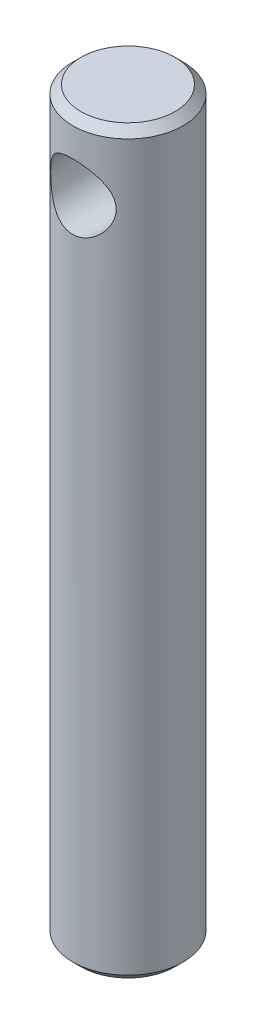
ISO-10303-21;
HEADER;
FILE_DESCRIPTION(('STEP AP214'),'2;1');
FILE_NAME('part.step','',(''),(''),'','','');
FILE_SCHEMA(('AUTOMOTIVE_DESIGN { 1 0 10303 214 1 1 1 1 }'));
ENDSEC;
DATA;
#1=APPLICATION_CONTEXT('core data for automotive mechanical design processes');
#2=APPLICATION_PROTOCOL_DEFINITION('international standard','automotive_design',2000,#1);
#3=PRODUCT_CONTEXT('',#1,'mechanical');
#4=PRODUCT('Part','Part','',(#3));
#5=PRODUCT_RELATED_PRODUCT_CATEGORY('part','',(#4));
#6=PRODUCT_DEFINITION_FORMATION('','',#4);
#7=PRODUCT_DEFINITION_CONTEXT('part definition',#1,'design');
#8=PRODUCT_DEFINITION('design','',#6,#7);
#9=PRODUCT_DEFINITION_SHAPE('','',#8);
#10=(LENGTH_UNIT() NAMED_UNIT(*) SI_UNIT(.MILLI.,.METRE.));
#11=(NAMED_UNIT(*) PLANE_ANGLE_UNIT() SI_UNIT($,.RADIAN.));
#12=(NAMED_UNIT(*) SI_UNIT($,.STERADIAN.) SOLID_ANGLE_UNIT());
#13=UNCERTAINTY_MEASURE_WITH_UNIT(LENGTH_MEASURE(1.E-05),#10,'distance_accuracy_value','');
#14=(GEOMETRIC_REPRESENTATION_CONTEXT(3) GLOBAL_UNCERTAINTY_ASSIGNED_CONTEXT((#13)) GLOBAL_UNIT_ASSIGNED_CONTEXT((#10,
#11,#12)) REPRESENTATION_CONTEXT('',''));
#15=CARTESIAN_POINT('',(0.,0.,0.));
#16=DIRECTION('',(0.,0.,1.));
#17=DIRECTION('',(1.,0.,0.));
#18=AXIS2_PLACEMENT_3D('',#15,#16,#17);
#19=CARTESIAN_POINT('',(0.,181.,0.));
#20=DIRECTION('',(0.,-1.,0.));
#21=DIRECTION('',(0.,0.,-1.));
#22=AXIS2_PLACEMENT_3D('',#19,#20,#21);
#23=CYLINDRICAL_SURFACE('',#22,13.5);
#24=CARTESIAN_POINT('',(0.,179.,0.));
#25=DIRECTION('',(0.,1.,0.));
#26=DIRECTION('',(0.,0.,1.));
#27=AXIS2_PLACEMENT_3D('',#24,#25,#26);
#28=CIRCLE('',#27,13.5);
#29=CARTESIAN_POINT('',(0.,179.,13.5));
#30=VERTEX_POINT('',#29);
#31=EDGE_CURVE('E39',#30,#30,#28,.F.);
#32=ORIENTED_EDGE('',*,*,#31,.T.);
#33=EDGE_LOOP('',(#32));
#34=FACE_BOUND('',#33,.T.);
#35=CARTESIAN_POINT('',(0.,2.,0.));
#36=DIRECTION('',(0.,1.,0.));
#37=DIRECTION('',(0.,0.,1.));
#38=AXIS2_PLACEMENT_3D('',#35,#36,#37);
#39=CIRCLE('',#38,13.5);
#40=CARTESIAN_POINT('',(0.,2.,13.5));
#41=VERTEX_POINT('',#40);
#42=EDGE_CURVE('E43',#41,#41,#39,.T.);
#43=ORIENTED_EDGE('',*,*,#42,.T.);
#44=EDGE_LOOP('',(#43));
#45=FACE_BOUND('',#44,.T.);
#46=CARTESIAN_POINT('',(0.,172.,-13.5));
#47=CARTESIAN_POINT('',(-0.205122931176962,171.999998343756,-13.4999984706654));
#48=CARTESIAN_POINT('',(-0.41030968731954,171.992098137591,-13.4953127723332));
#49=CARTESIAN_POINT('',(-0.819141753344282,171.960595967104,-13.4766810212997));
#50=CARTESIAN_POINT('',(-1.0227860123282,171.936984128209,-13.4627291449269));
#51=CARTESIAN_POINT('',(-1.42728944357705,171.874313427976,-13.4258768138681));
#52=CARTESIAN_POINT('',(-1.62814212125922,171.835223299433,-13.4029582469779));
#53=CARTESIAN_POINT('',(-2.02526903490092,171.742086703841,-13.3487255680575));
#54=CARTESIAN_POINT('',(-2.2215412711851,171.688033832243,-13.3174078610974));
#55=CARTESIAN_POINT('',(-2.60710044914417,171.56595647582,-13.2473097212851));
#56=CARTESIAN_POINT('',(-2.79641952640403,171.49800942811,-13.2085707223819));
#57=CARTESIAN_POINT('',(-3.16819309454819,171.348653371793,-13.1243629595229));
#58=CARTESIAN_POINT('',(-3.35064490164156,171.267239165798,-13.0788915980566));
#59=CARTESIAN_POINT('',(-3.70759632054505,171.091773017542,-12.9822141132811));
#60=CARTESIAN_POINT('',(-3.88210196567982,170.997730885075,-12.9310124465547));
#61=CARTESIAN_POINT('',(-4.2226206214687,170.797683998483,-12.8238603317318));
#62=CARTESIAN_POINT('',(-4.38863046858383,170.691674834685,-12.7679081350303));
#63=CARTESIAN_POINT('',(-4.89718414110188,170.339996691162,-12.5858330445619));
#64=CARTESIAN_POINT('',(-5.22341790700596,170.07380246969,-12.4529468182507));
#65=CARTESIAN_POINT('',(-5.82936656276922,169.494946649173,-12.1810937765254));
#66=CARTESIAN_POINT('',(-6.10902175775845,169.182226379139,-12.0421194422138));
#67=CARTESIAN_POINT('',(-6.50520782052548,168.662327776831,-11.8303992839742));
#68=CARTESIAN_POINT('',(-6.63936720209025,168.469263745104,-11.7554216876498));
#69=CARTESIAN_POINT('',(-6.8908652288587,168.070807118774,-11.609783433664));
#70=CARTESIAN_POINT('',(-7.00820120063715,167.865412572059,-11.5391234631425));
#71=CARTESIAN_POINT('',(-7.22484399489974,167.443515156213,-11.4047302769881));
#72=CARTESIAN_POINT('',(-7.32417406468949,167.227027080084,-11.3409881730563));
#73=CARTESIAN_POINT('',(-7.50381963098546,166.783846649798,-11.222934423756));
#74=CARTESIAN_POINT('',(-7.58414199724749,166.557158017684,-11.1686193731639));
#75=CARTESIAN_POINT('',(-7.70795943714299,166.14973876555,-11.0833927077012));
#76=CARTESIAN_POINT('',(-7.75567185156903,165.970802408651,-11.0499835537045));
#77=CARTESIAN_POINT('',(-7.83876309883678,165.608806310971,-10.991196056065));
#78=CARTESIAN_POINT('',(-7.87414459111243,165.425747468372,-10.9658159808844));
#79=CARTESIAN_POINT('',(-7.93208960481248,165.056783615112,-10.9239752592024));
#80=CARTESIAN_POINT('',(-7.95466580537518,164.87088160762,-10.9075057906269));
#81=CARTESIAN_POINT('',(-7.98672547282611,164.497345023897,-10.8840532203254));
#82=CARTESIAN_POINT('',(-7.99620870341151,164.309710416457,-10.8770702898131));
#83=CARTESIAN_POINT('',(-8.00193828874021,163.93379097889,-10.8728559818045));
#84=CARTESIAN_POINT('',(-7.99816084764292,163.745505586187,-10.8756421345971));
#85=CARTESIAN_POINT('',(-7.97737627294427,163.370065949334,-10.8908967202689));
#86=CARTESIAN_POINT('',(-7.96036907765031,163.182911710462,-10.9033651982984));
#87=CARTESIAN_POINT('',(-7.91337303541688,162.811019662174,-10.9375210319713));
#88=CARTESIAN_POINT('',(-7.88337852601511,162.626282943032,-10.9592124087195));
#89=CARTESIAN_POINT('',(-7.81080898822977,162.260442530172,-11.0110510917449));
#90=CARTESIAN_POINT('',(-7.76822883364468,162.079340348982,-11.041201843317));
#91=CARTESIAN_POINT('',(-7.67153392214044,161.723788188133,-11.1086001105235));
#92=CARTESIAN_POINT('',(-7.61754951032847,161.549287312154,-11.1457669635968));
#93=CARTESIAN_POINT('',(-7.49830790922817,161.205633614546,-11.2263329483964));
#94=CARTESIAN_POINT('',(-7.43304703041511,161.036482564811,-11.2697341191304));
#95=CARTESIAN_POINT('',(-7.22117432928154,160.538074590643,-11.4075872311667));
#96=CARTESIAN_POINT('',(-7.0584239814666,160.21768715253,-11.5097240115744));
#97=CARTESIAN_POINT('',(-6.66247402643238,159.551838280788,-11.7440543621878));
#98=CARTESIAN_POINT('',(-6.42198486582337,159.211467447191,-11.878400495209));
#99=CARTESIAN_POINT('',(-6.02466132616965,158.732497566782,-12.0820427711885));
#100=CARTESIAN_POINT('',(-5.88600161408107,158.57799915745,-12.1503304832045));
#101=CARTESIAN_POINT('',(-5.59686531747619,158.280018656814,-12.28619478169));
#102=CARTESIAN_POINT('',(-5.44638665906639,158.13653850768,-12.353771240985));
#103=CARTESIAN_POINT('',(-5.11342266365445,157.843012578185,-12.4955936502826));
#104=CARTESIAN_POINT('',(-4.92934072005559,157.694625523672,-12.5695334520902));
#105=CARTESIAN_POINT('',(-4.547609912739,157.414005009921,-12.7126224432408));
#106=CARTESIAN_POINT('',(-4.34996643209302,157.281765198526,-12.7817735117576));
#107=CARTESIAN_POINT('',(-3.94205841605494,157.034583098467,-12.9134074362129));
#108=CARTESIAN_POINT('',(-3.73179575996588,156.91963824306,-12.9758912812324));
#109=CARTESIAN_POINT('',(-3.29988979614193,156.708326471527,-13.0923920961945));
#110=CARTESIAN_POINT('',(-3.07824791157265,156.611957239337,-13.1464101215234));
#111=CARTESIAN_POINT('',(-2.63989262491531,156.444712590565,-13.2411455573001));
#112=CARTESIAN_POINT('',(-2.42379373851601,156.372588089131,-13.2824988684139));
#113=CARTESIAN_POINT('',(-1.98464521869019,156.246720575252,-13.3551749407203));
#114=CARTESIAN_POINT('',(-1.76159580134518,156.192976991994,-13.3864980133972));
#115=CARTESIAN_POINT('',(-1.31067843201884,156.104757850273,-13.4381386306378));
#116=CARTESIAN_POINT('',(-1.08281526319764,156.070264020151,-13.4584666110582));
#117=CARTESIAN_POINT('',(-0.624238580697323,156.021060133653,-13.4875157829987));
#118=CARTESIAN_POINT('',(-0.393525449189501,156.006347453135,-13.4962385140549));
#119=CARTESIAN_POINT('',(0.037876672442782,155.997576776386,-13.5014361348051));
#120=CARTESIAN_POINT('',(0.23850295490903,156.001045490512,-13.4993776671767));
#121=CARTESIAN_POINT('',(0.638640809631457,156.023015763461,-13.4863707718972));
#122=CARTESIAN_POINT('',(0.838152413410018,156.041516894989,-13.4754225969356));
#123=CARTESIAN_POINT('',(1.23455794778152,156.093305143134,-13.4449019138791));
#124=CARTESIAN_POINT('',(1.43145203899228,156.126591348145,-13.4253299375047));
#125=CARTESIAN_POINT('',(1.82126136798946,156.207526758632,-13.3780253653781));
#126=CARTESIAN_POINT('',(2.01417650025611,156.255176344495,-13.3502925535022));
#127=CARTESIAN_POINT('',(2.39085762808701,156.363156275801,-13.2879448244289));
#128=CARTESIAN_POINT('',(2.57473032701227,156.423203983128,-13.2534841015468));
#129=CARTESIAN_POINT('',(2.93650337424312,156.555933754035,-13.1780558295579));
#130=CARTESIAN_POINT('',(3.11440174298445,156.628619956985,-13.1370861490134));
#131=CARTESIAN_POINT('',(3.63772021230856,156.864649779632,-13.0056152632673));
#132=CARTESIAN_POINT('',(3.97303694654272,157.046043984512,-12.9065051976663));
#133=CARTESIAN_POINT('',(4.64414667633844,157.472644541888,-12.6814886425768));
#134=CARTESIAN_POINT('',(4.97635388183314,157.72252860721,-12.5538665397381));
#135=CARTESIAN_POINT('',(5.59683667009501,158.268822776691,-12.2897974702756));
#136=CARTESIAN_POINT('',(5.88506021395218,158.565287163469,-12.1533403181474));
#137=CARTESIAN_POINT('',(6.29750224230008,159.060824047299,-11.9423385209066));
#138=CARTESIAN_POINT('',(6.43837099779284,159.245881454074,-11.8667829553649));
#139=CARTESIAN_POINT('',(6.7040330382913,159.628483436868,-11.7187468487954));
#140=CARTESIAN_POINT('',(6.82882379796969,159.826029967273,-11.6462667920254));
#141=CARTESIAN_POINT('',(7.06125094454737,160.232570680755,-11.506828543792));
#142=CARTESIAN_POINT('',(7.16890262366966,160.441554432744,-11.4398654558908));
#143=CARTESIAN_POINT('',(7.36611990231876,160.87016326196,-11.3138841290262));
#144=CARTESIAN_POINT('',(7.455691303401,161.089784897592,-11.2548633435889));
#145=CARTESIAN_POINT('',(7.59831555682666,161.489927623979,-11.1589116515974));
#146=CARTESIAN_POINT('',(7.65507745225127,161.668649814471,-11.1199628798627));
#147=CARTESIAN_POINT('',(7.75617019210315,162.030949498007,-11.0496885843209));
#148=CARTESIAN_POINT('',(7.8005086014505,162.214523961541,-11.0183584229255));
#149=CARTESIAN_POINT('',(7.87621469797193,162.585421878416,-10.9643699469353));
#150=CARTESIAN_POINT('',(7.90759396053866,162.772741828694,-10.9417038947219));
#151=CARTESIAN_POINT('',(7.95699523265755,163.150046162119,-10.9058316583184));
#152=CARTESIAN_POINT('',(7.97501712893093,163.340030567848,-10.8926255543545));
#153=CARTESIAN_POINT('',(7.99745812033672,163.721867736,-10.8761602279497));
#154=CARTESIAN_POINT('',(8.0018321124445,163.913724595854,-10.8729339868456));
#155=CARTESIAN_POINT('',(7.996778112766,164.297156559766,-10.8766515466055));
#156=CARTESIAN_POINT('',(7.98735008406233,164.488731663069,-10.8835953746723));
#157=CARTESIAN_POINT('',(7.95483727212307,164.870187875616,-10.9073812508997));
#158=CARTESIAN_POINT('',(7.93174562421614,165.060068084629,-10.9242282744479));
#159=CARTESIAN_POINT('',(7.87225290532894,165.436655864536,-10.9671771278067));
#160=CARTESIAN_POINT('',(7.8358517253291,165.62336340943,-10.9932790334249));
#161=CARTESIAN_POINT('',(7.75194341298969,165.985057252961,-11.0525969465292));
#162=CARTESIAN_POINT('',(7.70493742499579,166.160213974115,-11.08548750366));
#163=CARTESIAN_POINT('',(7.59961179114273,166.505702153153,-11.1579558738974));
#164=CARTESIAN_POINT('',(7.54128831449775,166.676031954767,-11.1975359507106));
#165=CARTESIAN_POINT('',(7.35014402665028,167.178647907142,-11.3247003980992));
#166=CARTESIAN_POINT('',(7.20110593141275,167.50274480264,-11.4207410887993));
#167=CARTESIAN_POINT('',(6.83759533101135,168.173054345092,-11.6425574956993));
#168=CARTESIAN_POINT('',(6.61656952026614,168.514942501525,-11.7706347614511));
#169=CARTESIAN_POINT('',(6.24942221440435,168.998577087836,-11.9672101055936));
#170=CARTESIAN_POINT('',(6.12100398845159,169.155020281687,-12.0335258078162));
#171=CARTESIAN_POINT('',(5.85266870926557,169.457762676791,-12.1662915906787));
#172=CARTESIAN_POINT('',(5.71274980853131,169.604060241233,-12.2327416912298));
#173=CARTESIAN_POINT('',(5.39961220618118,169.907515499742,-12.3744932154749));
#174=CARTESIAN_POINT('',(5.22457710182643,170.062899085935,-12.4495896248399));
#175=CARTESIAN_POINT('',(4.86068650491981,170.358351172897,-12.5961177516524));
#176=CARTESIAN_POINT('',(4.67183545178352,170.498424557454,-12.6675506338437));
#177=CARTESIAN_POINT('',(4.28098686300635,170.762305913232,-12.8049241695868));
#178=CARTESIAN_POINT('',(4.07898067749012,170.886103017518,-12.8708611431256));
#179=CARTESIAN_POINT('',(3.66302585983885,171.116087339016,-12.9953588122696));
#180=CARTESIAN_POINT('',(3.44907886127284,171.222276957175,-13.0539205133003));
#181=CARTESIAN_POINT('',(3.01899528399243,171.412069673333,-13.159894388941));
#182=CARTESIAN_POINT('',(2.80325651083394,171.496382150513,-13.2076477255457));
#183=CARTESIAN_POINT('',(2.36354019375161,171.646411905496,-13.2933751193557));
#184=CARTESIAN_POINT('',(2.13956422012375,171.712132706965,-13.3313510295467));
#185=CARTESIAN_POINT('',(1.6859447781057,171.823808893194,-13.3962654258179));
#186=CARTESIAN_POINT('',(1.45632169501934,171.869826733885,-13.4232387755874));
#187=CARTESIAN_POINT('',(0.992996429170178,171.941588156701,-13.4654361798352));
#188=CARTESIAN_POINT('',(0.759297932027846,171.967349175702,-13.4806703390683));
#189=CARTESIAN_POINT('',(0.437483109511519,171.988509304819,-13.49319343359));
#190=CARTESIAN_POINT('',(0.350067216041159,171.99281650967,-13.4957441886123));
#191=CARTESIAN_POINT('',(0.175104760066532,171.998562242503,-13.4991478170144));
#192=CARTESIAN_POINT('',(0.0875581947125149,172.00000070698,-13.5000006528074));
#193=CARTESIAN_POINT('',(0.,172.,-13.5));
#194=B_SPLINE_CURVE_WITH_KNOTS('',3,(#46,#47,#48,#49,#50,#51,#52,#53,#54,#55,#56,#57,#58,#59,
#60,#61,#62,#63,#64,#65,#66,#67,#68,#69,#70,#71,#72,#73,#74,#75,#76,#77,#78,#79,#80,#81,#82,#83,
#84,#85,#86,#87,#88,#89,#90,#91,#92,#93,#94,#95,#96,#97,#98,#99,#100,#101,#102,#103,#104,#105,
#106,#107,#108,#109,#110,#111,#112,#113,#114,#115,#116,#117,#118,#119,#120,#121,#122,#123,#124,
#125,#126,#127,#128,#129,#130,#131,#132,#133,#134,#135,#136,#137,#138,#139,#140,#141,#142,#143,
#144,#145,#146,#147,#148,#149,#150,#151,#152,#153,#154,#155,#156,#157,#158,#159,#160,#161,#162,
#163,#164,#165,#166,#167,#168,#169,#170,#171,#172,#173,#174,#175,#176,#177,#178,#179,#180,#181,
#182,#183,#184,#185,#186,#187,#188,#189,#190,#191,#192,#193),.UNSPECIFIED.,.T.,.F.,(4,2,2,2,2,2,
2,2,2,2,2,2,2,2,2,2,2,2,2,2,2,2,2,2,2,2,2,2,2,2,2,2,2,2,2,2,2,2,2,2,2,2,2,2,2,2,2,2,2,2,2,2,2,2,
2,2,2,2,2,2,2,2,2,2,2,2,2,2,2,2,2,2,2,4),(0.,0.615275484959753,1.2309380288884,1.84785065057618,
2.46502774062069,3.07885451234468,3.69291873363486,4.30650865972083,4.92032542722162,
6.23936145598167,7.56007515979935,8.29959614649738,9.03923452128925,9.77791104447758,
10.5163201863829,11.0802870514803,11.6441322093692,12.2074180979311,12.7707141525833,
13.3350215398413,13.899331558577,14.4638878643332,15.0286744345496,15.5873248189246,
16.1461583343159,17.2632738786723,18.5715457407466,19.2266858012891,19.8819410784708,
20.6242194231251,21.3662048159258,22.1080799818841,22.849862588722,23.5434781118215,
24.2370720929322,24.9300065974601,25.6228491690924,26.2241032615038,26.8253402638966,
27.4265402008261,28.0277560607945,28.6165378710193,29.2055128839596,30.3826068702004,
31.6822635868828,32.9834462549484,33.7163353828148,34.449339483624,35.1816858564231,
35.9137968608352,36.4877987881714,37.0614504303846,37.6345885603747,38.2077315508766,
38.7827666451384,39.3578032774961,39.933129056755,40.5084595486651,41.0608316518112,
41.6133910510987,42.7179397420539,43.9932133815707,44.6317328260275,45.2703550452832,
46.0068938813791,46.7431970796166,47.4799894044086,48.2166811778527,48.9251533770453,
49.6334912099232,50.3395667710115,51.0450338817082,51.3076628226638,51.5702975773684),.UNSPECIFIED.);
#195=CARTESIAN_POINT('',(0.,172.,-13.5));
#196=VERTEX_POINT('',#195);
#197=EDGE_CURVE('E52',#196,#196,#194,.T.);
#198=ORIENTED_EDGE('',*,*,#197,.T.);
#199=EDGE_LOOP('',(#198));
#200=FACE_BOUND('',#199,.T.);
#201=CARTESIAN_POINT('',(8.00000000000001,164.,10.8742815854658));
#202=CARTESIAN_POINT('',(8.00000066972051,163.79812704354,10.8742806182195));
#203=CARTESIAN_POINT('',(7.99234765156944,163.596261882585,10.8799236092202));
#204=CARTESIAN_POINT('',(7.96187674608718,163.194306900145,10.9022416615779));
#205=CARTESIAN_POINT('',(7.93905932909487,162.994217023794,10.9189163807748));
#206=CARTESIAN_POINT('',(7.87862205678978,162.59726566884,10.9626044886695));
#207=CARTESIAN_POINT('',(7.8409890259066,162.400407226732,10.9896270791748));
#208=CARTESIAN_POINT('',(7.7514935420731,162.011489183875,11.0529337378418));
#209=CARTESIAN_POINT('',(7.69963048168375,161.819429788364,11.0892182013616));
#210=CARTESIAN_POINT('',(7.58277091402704,161.442616047927,11.1694477063965));
#211=CARTESIAN_POINT('',(7.51787344274846,161.257818482169,11.2133346573902));
#212=CARTESIAN_POINT('',(7.37537290766844,160.894856217774,11.3075714777897));
#213=CARTESIAN_POINT('',(7.29776487969243,160.716694144164,11.3579238706416));
#214=CARTESIAN_POINT('',(7.04689046357685,160.193297536408,11.5165294322246));
#215=CARTESIAN_POINT('',(6.85549612730816,159.858905864772,11.6323867756658));
#216=CARTESIAN_POINT('',(6.40338137662062,159.185411262126,11.8878805091604));
#217=CARTESIAN_POINT('',(6.13712303966872,158.850478148087,12.0287061960164));
#218=CARTESIAN_POINT('',(5.70026551841599,158.382833652492,12.238596600125));
#219=CARTESIAN_POINT('',(5.54828398649875,158.232653451382,12.3083828745601));
#220=CARTESIAN_POINT('',(5.23223995619095,157.944474498362,12.4460168052709));
#221=CARTESIAN_POINT('',(5.06817537137077,157.806477859324,12.5138641239187));
#222=CARTESIAN_POINT('',(4.71078077135598,157.529694730334,12.6530264824128));
#223=CARTESIAN_POINT('',(4.51618624394185,157.39234424597,12.7239585619106));
#224=CARTESIAN_POINT('',(4.11404786927368,157.134754835067,12.8596115402171));
#225=CARTESIAN_POINT('',(3.90650982369288,157.014508320187,12.9243351892788));
#226=CARTESIAN_POINT('',(3.47967167743076,156.792383391821,13.0457307108672));
#227=CARTESIAN_POINT('',(3.2603765023153,156.690497363164,13.1024059194772));
#228=CARTESIAN_POINT('',(2.81147420129082,156.506373608097,13.2060077355363));
#229=CARTESIAN_POINT('',(2.58186872600856,156.424132749824,13.2529358967187));
#230=CARTESIAN_POINT('',(2.13613591346709,156.287278218098,13.331663463081));
#231=CARTESIAN_POINT('',(1.92075815409436,156.230799328474,13.3644676910051));
#232=CARTESIAN_POINT('',(1.4847780021082,156.135828562779,13.4198994564764));
#233=CARTESIAN_POINT('',(1.26417590758507,156.097335663049,13.4425275731869));
#234=CARTESIAN_POINT('',(0.819850673621856,156.038968889252,13.4769232627921));
#235=CARTESIAN_POINT('',(0.596130033507542,156.019080887432,13.4886990763538));
#236=CARTESIAN_POINT('',(0.147508331015862,155.998209643094,13.5010582768779));
#237=CARTESIAN_POINT('',(-0.0773926134354867,155.997224546618,13.5016427614625));
#238=CARTESIAN_POINT('',(-0.498981178809007,156.013137267787,13.4922181317775));
#239=CARTESIAN_POINT('',(-0.69578324849336,156.027881250192,13.4834849070384));
#240=CARTESIAN_POINT('',(-1.08721419571642,156.071775353704,13.4575789196585));
#241=CARTESIAN_POINT('',(-1.28184308034781,156.100925427779,13.4404061845703));
#242=CARTESIAN_POINT('',(-1.66756943769057,156.173268843967,13.3980171261845));
#243=CARTESIAN_POINT('',(-1.858666957779,156.216461997532,13.372800910882));
#244=CARTESIAN_POINT('',(-2.23612345882929,156.316389220463,13.314887101475));
#245=CARTESIAN_POINT('',(-2.42248224563115,156.373123843678,13.2821892013707));
#246=CARTESIAN_POINT('',(-2.79057204079766,156.499944331085,13.2097730947892));
#247=CARTESIAN_POINT('',(-2.97226587515723,156.570113180647,13.1700113701964));
#248=CARTESIAN_POINT('',(-3.3288862991208,156.722899320056,13.0844259940756));
#249=CARTESIAN_POINT('',(-3.50381060615082,156.805520763535,13.0386003205079));
#250=CARTESIAN_POINT('',(-4.01716303753441,157.071028634323,12.89335404919));
#251=CARTESIAN_POINT('',(-4.34441275526408,157.271642979083,12.7861147782938));
#252=CARTESIAN_POINT('',(-5.00040625183953,157.740807442118,12.5452081962363));
#253=CARTESIAN_POINT('',(-5.32478086132628,158.014577588094,12.4099157432865));
#254=CARTESIAN_POINT('',(-5.92590775019193,158.609043121832,12.1343708755145));
#255=CARTESIAN_POINT('',(-6.20259615183108,158.929800403741,11.9941121064637));
#256=CARTESIAN_POINT('',(-6.59198857638869,159.461150007594,11.7822287770144));
#257=CARTESIAN_POINT('',(-6.72298011210508,159.6574734322,11.7077644637116));
#258=CARTESIAN_POINT('',(-6.96784464263477,160.062350390613,11.5637055699649));
#259=CARTESIAN_POINT('',(-7.08171493975023,160.27090584457,11.49411175786));
#260=CARTESIAN_POINT('',(-7.2910613463914,160.69892332292,11.3624693916631));
#261=CARTESIAN_POINT('',(-7.3865649050898,160.918368445308,11.3004096299017));
#262=CARTESIAN_POINT('',(-7.55818112446816,161.367214160588,11.1863546128059));
#263=CARTESIAN_POINT('',(-7.63430119111729,161.596610911874,11.1343555153616));
#264=CARTESIAN_POINT('',(-7.74992532438249,162.006909127494,11.0540639339352));
#265=CARTESIAN_POINT('',(-7.79383229608195,162.186054526585,11.023081108003));
#266=CARTESIAN_POINT('',(-7.86932166237166,162.548121215735,10.9693177627054));
#267=CARTESIAN_POINT('',(-7.90090669929915,162.731041687392,10.9465354848813));
#268=CARTESIAN_POINT('',(-7.95131211026934,163.099359537829,10.9099774759348));
#269=CARTESIAN_POINT('',(-7.97014415742282,163.284754492691,10.8961935088648));
#270=CARTESIAN_POINT('',(-7.99481308481208,163.656878721409,10.8781064860126));
#271=CARTESIAN_POINT('',(-8.00064967259345,163.8436080252,10.873803643597));
#272=CARTESIAN_POINT('',(-7.9992347668847,164.217202907764,10.8748445425119));
#273=CARTESIAN_POINT('',(-7.99196832686486,164.404068398809,10.8801993001988));
#274=CARTESIAN_POINT('',(-7.96443130003922,164.776317532398,10.9003725691683));
#275=CARTESIAN_POINT('',(-7.94416064970174,164.9617011677,10.915191126686));
#276=CARTESIAN_POINT('',(-7.89090068651352,165.329768336659,10.9537556351855));
#277=CARTESIAN_POINT('',(-7.85790542157277,165.512450565117,10.9775057638867));
#278=CARTESIAN_POINT('',(-7.77961996656757,165.873963430057,11.0331234807391));
#279=CARTESIAN_POINT('',(-7.73432477346561,166.052792467224,11.0649943717119));
#280=CARTESIAN_POINT('',(-7.6318505711262,166.40598039553,11.1359212687022));
#281=CARTESIAN_POINT('',(-7.57464583897916,166.580328677754,11.1749928057706));
#282=CARTESIAN_POINT('',(-7.44895405973561,166.923437859466,11.2591652146267));
#283=CARTESIAN_POINT('',(-7.380463308554,167.092196902647,11.3042680649797));
#284=CARTESIAN_POINT('',(-7.15889310498915,167.589116485458,11.4468819902924));
#285=CARTESIAN_POINT('',(-6.9896662969808,167.908087496684,11.5517340857843));
#286=CARTESIAN_POINT('',(-6.57850256752418,168.571820423671,11.7914923852851));
#287=CARTESIAN_POINT('',(-6.32899962365351,168.911167596101,11.928434332397));
#288=CARTESIAN_POINT('',(-5.91772228860953,169.387453996077,12.1348364567161));
#289=CARTESIAN_POINT('',(-5.77433409613036,169.540866357154,12.203855796772));
#290=CARTESIAN_POINT('',(-5.47560471247903,169.836254403276,12.340774507865));
#291=CARTESIAN_POINT('',(-5.3202614430214,169.978228090986,12.4086736816681));
#292=CARTESIAN_POINT('',(-4.97851669349686,170.266600720948,12.5500046277098));
#293=CARTESIAN_POINT('',(-4.79063953658722,170.411420708276,12.6230986836248));
#294=CARTESIAN_POINT('',(-4.40149316231173,170.684559456021,12.7639983631136));
#295=CARTESIAN_POINT('',(-4.20022950793767,170.812885006773,12.8318061583519));
#296=CARTESIAN_POINT('',(-3.78534019926853,171.051842775308,12.9602599950957));
#297=CARTESIAN_POINT('',(-3.57171783694572,171.16247967551,13.0209079307949));
#298=CARTESIAN_POINT('',(-3.13341828413447,171.364775729557,13.1332724158548));
#299=CARTESIAN_POINT('',(-2.90874262144534,171.456437497095,13.1849901951198));
#300=CARTESIAN_POINT('',(-2.46734890598543,171.613332795733,13.2743739395445));
#301=CARTESIAN_POINT('',(-2.25130947404957,171.680038539342,13.3128057027469));
#302=CARTESIAN_POINT('',(-1.81287463449185,171.795180603957,13.3795603882069));
#303=CARTESIAN_POINT('',(-1.59047948377262,171.843617662276,13.4078837184321));
#304=CARTESIAN_POINT('',(-1.14146354453081,171.921422373528,13.4535475042529));
#305=CARTESIAN_POINT('',(-0.914846678555971,171.950806900586,13.4708976780336));
#306=CARTESIAN_POINT('',(-0.459353740993128,171.990070528567,13.4941087787144));
#307=CARTESIAN_POINT('',(-0.230477946359063,171.999951991509,13.4999710969101));
#308=CARTESIAN_POINT('',(0.197680118516687,172.000041501162,13.5000249883105));
#309=CARTESIAN_POINT('',(0.396966811714397,171.992625547187,13.4956260550064));
#310=CARTESIAN_POINT('',(0.794049028718544,171.96298416439,13.4780922883792));
#311=CARTESIAN_POINT('',(0.99184458178071,171.940759026888,13.464957626902));
#312=CARTESIAN_POINT('',(1.38449237558049,171.881788892737,13.4302654187407));
#313=CARTESIAN_POINT('',(1.57934473833651,171.84504449975,13.4087082222379));
#314=CARTESIAN_POINT('',(1.96479894084893,171.757488806792,13.3576707928985));
#315=CARTESIAN_POINT('',(2.15540064432285,171.706677056498,13.3281903064238));
#316=CARTESIAN_POINT('',(2.52904954643741,171.592209554794,13.2623330300385));
#317=CARTESIAN_POINT('',(2.71215792068128,171.528706066766,13.2260382775582));
#318=CARTESIAN_POINT('',(3.07212970584001,171.389136159315,13.1470923043903));
#319=CARTESIAN_POINT('',(3.24899103487616,171.313065598876,13.1044389889261));
#320=CARTESIAN_POINT('',(3.76884437030429,171.067007700868,12.9681851526297));
#321=CARTESIAN_POINT('',(4.10136564669905,170.879093513504,12.8662431542773));
#322=CARTESIAN_POINT('',(4.76742535868178,170.438050562857,12.6356378586303));
#323=CARTESIAN_POINT('',(5.09710295464035,170.180038911923,12.5052718000994));
#324=CARTESIAN_POINT('',(5.71126284959763,169.617385749871,12.2369841317398));
#325=CARTESIAN_POINT('',(5.99569258993646,169.312690807303,12.0990539820591));
#326=CARTESIAN_POINT('',(6.40057894634099,168.804904785338,11.8873747100098));
#327=CARTESIAN_POINT('',(6.53821520911882,168.615909381138,11.8120248314661));
#328=CARTESIAN_POINT('',(6.79705102125059,168.225508749341,11.6649995659689));
#329=CARTESIAN_POINT('',(6.91824845718309,168.02410193093,11.5933246522146));
#330=CARTESIAN_POINT('',(7.14312334989109,167.6098893522,11.4561400462719));
#331=CARTESIAN_POINT('',(7.24681106818966,167.397090365218,11.3906267531271));
#332=CARTESIAN_POINT('',(7.43563389212614,166.961039077412,11.2682745881675));
#333=CARTESIAN_POINT('',(7.52077447936096,166.737789888903,11.2114331548805));
#334=CARTESIAN_POINT('',(7.6619295258681,166.310614920417,11.115358508138));
#335=CARTESIAN_POINT('',(7.72025108445345,166.107746528283,11.0748138677424));
#336=CARTESIAN_POINT('',(7.82092165058271,165.696455104954,11.003953082215));
#337=CARTESIAN_POINT('',(7.86328184221094,165.488036073125,10.9736297765997));
#338=CARTESIAN_POINT('',(7.93132977061989,165.067398152432,10.9245492339337));
#339=CARTESIAN_POINT('',(7.95703794754929,164.85518425196,10.9057778184951));
#340=CARTESIAN_POINT('',(7.99137217134949,164.428643883396,10.8806448966479));
#341=CARTESIAN_POINT('',(7.99999928899414,164.214317548575,10.8742826123385));
#342=CARTESIAN_POINT('',(8.00000000000001,164.,10.8742815854658));
#343=B_SPLINE_CURVE_WITH_KNOTS('',3,(#201,#202,#203,#204,#205,#206,#207,#208,#209,#210,#211,
#212,#213,#214,#215,#216,#217,#218,#219,#220,#221,#222,#223,#224,#225,#226,#227,#228,#229,#230,
#231,#232,#233,#234,#235,#236,#237,#238,#239,#240,#241,#242,#243,#244,#245,#246,#247,#248,#249,
#250,#251,#252,#253,#254,#255,#256,#257,#258,#259,#260,#261,#262,#263,#264,#265,#266,#267,#268,
#269,#270,#271,#272,#273,#274,#275,#276,#277,#278,#279,#280,#281,#282,#283,#284,#285,#286,#287,
#288,#289,#290,#291,#292,#293,#294,#295,#296,#297,#298,#299,#300,#301,#302,#303,#304,#305,#306,
#307,#308,#309,#310,#311,#312,#313,#314,#315,#316,#317,#318,#319,#320,#321,#322,#323,#324,#325,
#326,#327,#328,#329,#330,#331,#332,#333,#334,#335,#336,#337,#338,#339,#340,#341,#342),
.UNSPECIFIED.,.T.,.F.,(4,2,2,2,2,2,2,2,2,2,2,2,2,2,2,2,2,2,2,2,2,2,2,2,2,2,2,2,2,2,2,2,2,2,2,2,
2,2,2,2,2,2,2,2,2,2,2,2,2,2,2,2,2,2,2,2,2,2,2,2,2,2,2,2,2,2,2,2,2,2,4),(0.,0.605384902417651,
1.21075102909758,1.81665673023763,2.42258829977375,3.02407920740918,3.62580559312912,
4.82847285497897,6.17417937603743,6.84795934685343,7.52185593599952,8.26645252180086,
9.01071772289357,9.75467351949457,10.4985106342442,11.172735507268,11.8469220025915,
12.5205961333695,13.1942041912462,13.7861367238973,14.3780673240749,14.9699899770892,
15.561936843983,16.1576656669694,16.7535936402504,17.9446744621886,19.2761272558961,
20.6093499551273,21.3510087265419,22.0927842347975,22.8334423912874,23.5738171339451,
24.1343422896617,24.6947471792255,25.2546384211999,25.8145422630372,26.3750851872345,
26.9356308499686,27.4964390332655,28.0574756697667,28.6197368760629,29.1821829860608,
30.3065441726069,31.6297454331613,32.2923718365373,32.9551136930537,33.6988349563787,
34.44224906146,35.1854660480109,35.9285805933435,36.6156268370087,37.3026453489503,
37.9890545597266,38.6753806342598,39.2730677897656,39.8707431881479,40.4683937397934,
41.0660634255389,41.6569521961063,42.2480360621017,43.4293837337967,44.7398453384578,
46.0518181963849,46.7880037751723,47.5242839105027,48.2601310419913,48.9957603982154,
49.6397484681408,50.2832844546079,50.9260290038329,51.5687332595471),.UNSPECIFIED.);
#344=CARTESIAN_POINT('',(8.00000000000001,164.,10.8742815854658));
#345=VERTEX_POINT('',#344);
#346=EDGE_CURVE('E60',#345,#345,#343,.T.);
#347=ORIENTED_EDGE('',*,*,#346,.T.);
#348=EDGE_LOOP('',(#347));
#349=FACE_BOUND('',#348,.T.);
#350=ADVANCED_FACE('F32',(#34,#45,#200,#349),#23,.T.);
#351=CARTESIAN_POINT('',(0.,181.,0.));
#352=DIRECTION('',(0.,1.,0.));
#353=DIRECTION('',(0.,0.,1.));
#354=AXIS2_PLACEMENT_3D('',#351,#352,#353);
#355=PLANE('',#354);
#356=CARTESIAN_POINT('',(0.,181.,0.));
#357=DIRECTION('',(0.,1.,0.));
#358=DIRECTION('',(0.,0.,1.));
#359=AXIS2_PLACEMENT_3D('',#356,#357,#358);
#360=CIRCLE('',#359,11.5);
#361=CARTESIAN_POINT('',(0.,181.,11.5));
#362=VERTEX_POINT('',#361);
#363=EDGE_CURVE('E47',#362,#362,#360,.T.);
#364=ORIENTED_EDGE('',*,*,#363,.T.);
#365=EDGE_LOOP('',(#364));
#366=FACE_BOUND('',#365,.T.);
#367=ADVANCED_FACE('F73',(#366),#355,.T.);
#368=CARTESIAN_POINT('',(0.,0.,0.));
#369=DIRECTION('',(0.,1.,0.));
#370=DIRECTION('',(0.,0.,1.));
#371=AXIS2_PLACEMENT_3D('',#368,#369,#370);
#372=PLANE('',#371);
#373=CARTESIAN_POINT('',(0.,0.,0.));
#374=DIRECTION('',(0.,1.,0.));
#375=DIRECTION('',(0.,0.,1.));
#376=AXIS2_PLACEMENT_3D('',#373,#374,#375);
#377=CIRCLE('',#376,11.4999999999999);
#378=CARTESIAN_POINT('',(0.,0.,11.4999999999999));
#379=VERTEX_POINT('',#378);
#380=EDGE_CURVE('E10',#379,#379,#377,.F.);
#381=ORIENTED_EDGE('',*,*,#380,.T.);
#382=EDGE_LOOP('',(#381));
#383=FACE_BOUND('',#382,.T.);
#384=ADVANCED_FACE('F71',(#383),#372,.F.);
#385=CARTESIAN_POINT('',(0.,164.,-13.5));
#386=DIRECTION('',(0.,0.,1.));
#387=DIRECTION('',(1.,0.,0.));
#388=AXIS2_PLACEMENT_3D('',#385,#386,#387);
#389=CYLINDRICAL_SURFACE('',#388,8.00000000000001);
#390=ORIENTED_EDGE('',*,*,#346,.F.);
#391=EDGE_LOOP('',(#390));
#392=FACE_BOUND('',#391,.T.);
#393=ORIENTED_EDGE('',*,*,#197,.F.);
#394=EDGE_LOOP('',(#393));
#395=FACE_BOUND('',#394,.T.);
#396=ADVANCED_FACE('F66',(#392,#395),#389,.F.);
#397=CARTESIAN_POINT('',(0.,181.,0.));
#398=DIRECTION('',(0.,-1.,0.));
#399=DIRECTION('',(0.,0.,-1.));
#400=AXIS2_PLACEMENT_3D('',#397,#398,#399);
#401=CONICAL_SURFACE('',#400,11.5,0.785398163397453);
#402=ORIENTED_EDGE('',*,*,#31,.F.);
#403=EDGE_LOOP('',(#402));
#404=FACE_BOUND('',#403,.T.);
#405=ORIENTED_EDGE('',*,*,#363,.F.);
#406=EDGE_LOOP('',(#405));
#407=FACE_BOUND('',#406,.T.);
#408=ADVANCED_FACE('F70',(#404,#407),#401,.T.);
#409=CARTESIAN_POINT('',(0.,2.,0.));
#410=DIRECTION('',(0.,1.,0.));
#411=DIRECTION('',(0.,0.,1.));
#412=AXIS2_PLACEMENT_3D('',#409,#410,#411);
#413=CONICAL_SURFACE('',#412,13.5,0.785398163397456);
#414=ORIENTED_EDGE('',*,*,#380,.F.);
#415=EDGE_LOOP('',(#414));
#416=FACE_BOUND('',#415,.T.);
#417=ORIENTED_EDGE('',*,*,#42,.F.);
#418=EDGE_LOOP('',(#417));
#419=FACE_BOUND('',#418,.T.);
#420=ADVANCED_FACE('F34',(#416,#419),#413,.T.);
#421=CLOSED_SHELL('',(#350,#367,#384,#396,#408,#420));
#422=MANIFOLD_SOLID_BREP('B2',#421);
#423=ADVANCED_BREP_SHAPE_REPRESENTATION('',(#18,#422),#14);
#424=SHAPE_DEFINITION_REPRESENTATION(#9,#423);
ENDSEC;
END-ISO-10303-21;
